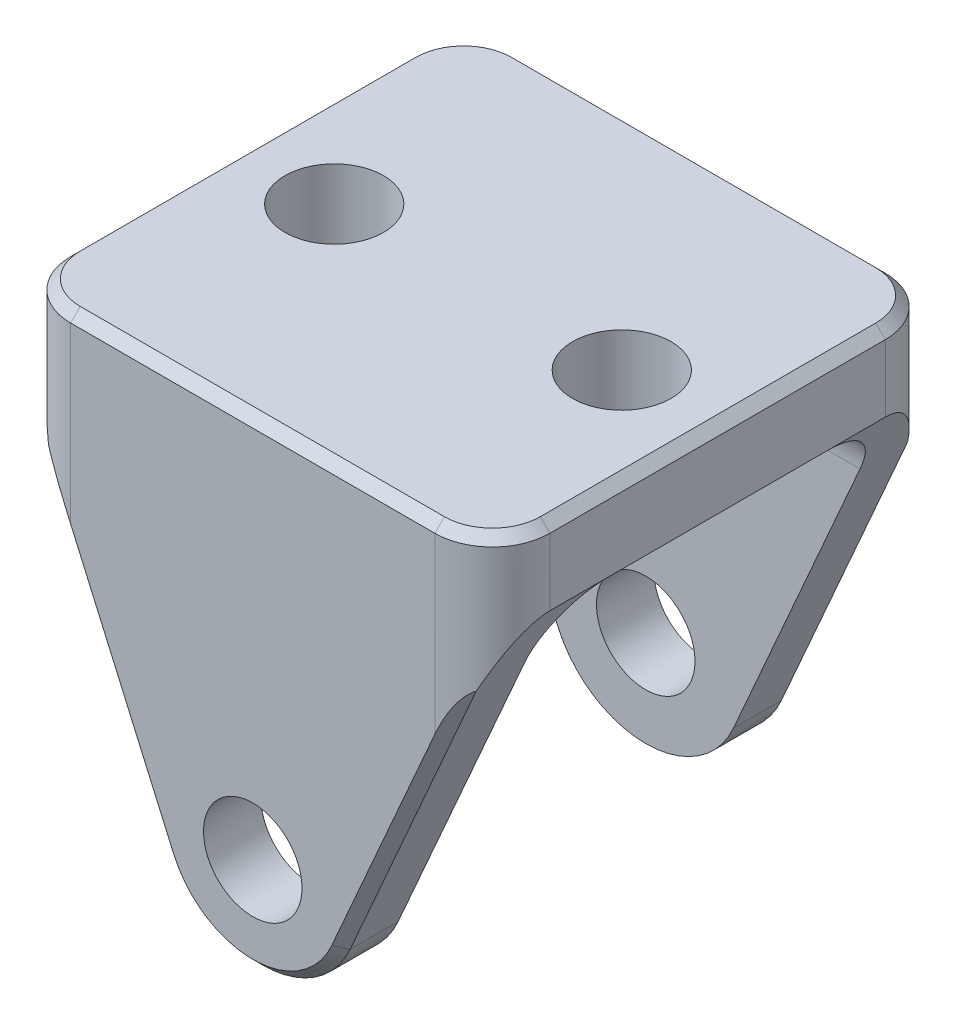
ISO-10303-21;
HEADER;
FILE_DESCRIPTION(('STEP AP214'),'2;1');
FILE_NAME('part.step','',(''),(''),'','','');
FILE_SCHEMA(('AUTOMOTIVE_DESIGN { 1 0 10303 214 1 1 1 1 }'));
ENDSEC;
DATA;
#1=APPLICATION_CONTEXT('core data for automotive mechanical design processes');
#2=APPLICATION_PROTOCOL_DEFINITION('international standard','automotive_design',2000,#1);
#3=PRODUCT_CONTEXT('',#1,'mechanical');
#4=PRODUCT('Part','Part','',(#3));
#5=PRODUCT_RELATED_PRODUCT_CATEGORY('part','',(#4));
#6=PRODUCT_DEFINITION_FORMATION('','',#4);
#7=PRODUCT_DEFINITION_CONTEXT('part definition',#1,'design');
#8=PRODUCT_DEFINITION('design','',#6,#7);
#9=PRODUCT_DEFINITION_SHAPE('','',#8);
#10=(LENGTH_UNIT() NAMED_UNIT(*) SI_UNIT(.MILLI.,.METRE.));
#11=(NAMED_UNIT(*) PLANE_ANGLE_UNIT() SI_UNIT($,.RADIAN.));
#12=(NAMED_UNIT(*) SI_UNIT($,.STERADIAN.) SOLID_ANGLE_UNIT());
#13=UNCERTAINTY_MEASURE_WITH_UNIT(LENGTH_MEASURE(1.E-05),#10,'distance_accuracy_value','');
#14=(GEOMETRIC_REPRESENTATION_CONTEXT(3) GLOBAL_UNCERTAINTY_ASSIGNED_CONTEXT((#13)) GLOBAL_UNIT_ASSIGNED_CONTEXT((#10,
#11,#12)) REPRESENTATION_CONTEXT('',''));
#15=CARTESIAN_POINT('',(0.,0.,0.));
#16=DIRECTION('',(0.,0.,1.));
#17=DIRECTION('',(1.,0.,0.));
#18=AXIS2_PLACEMENT_3D('',#15,#16,#17);
#19=CARTESIAN_POINT('',(15.24,520.7,306.5145));
#20=DIRECTION('',(0.,0.,-1.));
#21=DIRECTION('',(-1.,0.,0.));
#22=AXIS2_PLACEMENT_3D('',#19,#20,#21);
#23=CYLINDRICAL_SURFACE('',#22,6.34999999999999);
#24=DIRECTION('',(0.,0.,-1.));
#25=VECTOR('',#24,1.);
#26=CARTESIAN_POINT('',(21.0525596974217,518.143312736389,306.5145));
#27=LINE('',#26,#25);
#28=CARTESIAN_POINT('',(21.0525596974217,518.143312736389,305.8795));
#29=VERTEX_POINT('',#28);
#30=CARTESIAN_POINT('',(21.0525596974217,518.143312736389,302.7045));
#31=VERTEX_POINT('',#30);
#32=EDGE_CURVE('E225',#29,#31,#27,.T.);
#33=ORIENTED_EDGE('',*,*,#32,.F.);
#34=CARTESIAN_POINT('',(15.24,520.7,305.8795));
#35=DIRECTION('',(0.,0.,1.));
#36=DIRECTION('',(1.,0.,0.));
#37=AXIS2_PLACEMENT_3D('',#34,#35,#36);
#38=CIRCLE('',#37,6.34999999999999);
#39=CARTESIAN_POINT('',(9.42744030257833,518.143312736389,305.8795));
#40=VERTEX_POINT('',#39);
#41=EDGE_CURVE('E296',#29,#40,#38,.F.);
#42=ORIENTED_EDGE('',*,*,#41,.T.);
#43=DIRECTION('',(0.,0.,-1.));
#44=VECTOR('',#43,1.);
#45=CARTESIAN_POINT('',(9.42744030257833,518.143312736389,306.5145));
#46=LINE('',#45,#44);
#47=CARTESIAN_POINT('',(9.42744030257834,518.143312736389,302.7045));
#48=VERTEX_POINT('',#47);
#49=EDGE_CURVE('E232',#40,#48,#46,.T.);
#50=ORIENTED_EDGE('',*,*,#49,.T.);
#51=CARTESIAN_POINT('',(15.24,520.7,302.7045));
#52=DIRECTION('',(0.,0.,1.));
#53=DIRECTION('',(0.,-1.,0.));
#54=AXIS2_PLACEMENT_3D('',#51,#52,#53);
#55=CIRCLE('',#54,6.34999999999999);
#56=EDGE_CURVE('E237',#48,#31,#55,.T.);
#57=ORIENTED_EDGE('',*,*,#56,.T.);
#58=EDGE_LOOP('',(#33,#42,#50,#57));
#59=FACE_BOUND('',#58,.T.);
#60=ADVANCED_FACE('F40',(#59),#23,.T.);
#61=CARTESIAN_POINT('',(31.115,541.02,306.5145));
#62=DIRECTION('',(-0.91536373187743,0.402627915529243,0.));
#63=DIRECTION('',(-0.402627915529243,-0.91536373187743,0.));
#64=AXIS2_PLACEMENT_3D('',#61,#62,#63);
#65=PLANE('',#64);
#66=DIRECTION('',(0.,0.,-1.));
#67=VECTOR('',#66,1.);
#68=CARTESIAN_POINT('',(31.115,541.02,306.5145));
#69=LINE('',#68,#67);
#70=CARTESIAN_POINT('',(31.115,541.02,302.7045));
#71=VERTEX_POINT('',#70);
#72=CARTESIAN_POINT('',(31.115,541.02,298.8945));
#73=VERTEX_POINT('',#72);
#74=EDGE_CURVE('E244',#71,#73,#69,.T.);
#75=ORIENTED_EDGE('',*,*,#74,.F.);
#76=CARTESIAN_POINT('',(27.305,532.358067521054,302.7045));
#77=DIRECTION('',(-0.91536373187743,0.402627915529243,0.));
#78=DIRECTION('',(-0.402627915529244,-0.915363731877431,0.));
#79=AXIS2_PLACEMENT_3D('',#76,#77,#78);
#80=ELLIPSE('',#79,9.46283119736456,3.81);
#81=CARTESIAN_POINT('',(29.4110567418757,537.146130853063,305.8795));
#82=VERTEX_POINT('',#81);
#83=EDGE_CURVE('E343',#71,#82,#80,.F.);
#84=ORIENTED_EDGE('',*,*,#83,.T.);
#85=DIRECTION('',(-0.402627915529243,-0.91536373187743,0.));
#86=VECTOR('',#85,1.);
#87=CARTESIAN_POINT('',(21.0525596974217,518.143312736389,305.8795));
#88=LINE('',#87,#86);
#89=EDGE_CURVE('E298',#82,#29,#88,.T.);
#90=ORIENTED_EDGE('',*,*,#89,.T.);
#91=ORIENTED_EDGE('',*,*,#32,.T.);
#92=DIRECTION('',(0.402627915529243,0.91536373187743,0.));
#93=VECTOR('',#92,1.);
#94=CARTESIAN_POINT('',(31.115,541.02,302.7045));
#95=LINE('',#94,#93);
#96=CARTESIAN_POINT('',(29.4391499474531,537.21,302.7045));
#97=VERTEX_POINT('',#96);
#98=EDGE_CURVE('E233',#31,#97,#95,.T.);
#99=ORIENTED_EDGE('',*,*,#98,.T.);
#100=CARTESIAN_POINT('',(29.4391499474531,537.21,298.8945));
#101=DIRECTION('',(-0.91536373187743,0.402627915529243,0.));
#102=DIRECTION('',(-0.402627915529243,-0.91536373187743,0.));
#103=AXIS2_PLACEMENT_3D('',#100,#101,#102);
#104=ELLIPSE('',#103,4.16227983184959,3.81);
#105=EDGE_CURVE('E268',#97,#73,#104,.T.);
#106=ORIENTED_EDGE('',*,*,#105,.T.);
#107=EDGE_LOOP('',(#75,#84,#90,#91,#99,#106));
#108=FACE_BOUND('',#107,.T.);
#109=ADVANCED_FACE('F454',(#108),#65,.F.);
#110=CARTESIAN_POINT('',(9.42744030257833,518.143312736389,306.5145));
#111=DIRECTION('',(0.91536373187743,0.402627915529244,0.));
#112=DIRECTION('',(-0.402627915529244,0.91536373187743,0.));
#113=AXIS2_PLACEMENT_3D('',#110,#111,#112);
#114=PLANE('',#113);
#115=DIRECTION('',(-0.402627915529244,0.91536373187743,0.));
#116=VECTOR('',#115,1.);
#117=CARTESIAN_POINT('',(-0.635000000000023,541.02,305.8795));
#118=LINE('',#117,#116);
#119=CARTESIAN_POINT('',(1.06894325812434,537.146130853063,305.8795));
#120=VERTEX_POINT('',#119);
#121=EDGE_CURVE('E293',#40,#120,#118,.T.);
#122=ORIENTED_EDGE('',*,*,#121,.T.);
#123=CARTESIAN_POINT('',(3.17499999999996,532.358067521054,302.7045));
#124=DIRECTION('',(0.91536373187743,0.402627915529244,0.));
#125=DIRECTION('',(-0.402627915529244,0.91536373187743,0.));
#126=AXIS2_PLACEMENT_3D('',#123,#124,#125);
#127=ELLIPSE('',#126,9.46283119736454,3.81);
#128=CARTESIAN_POINT('',(-0.635000000000018,541.02,302.7045));
#129=VERTEX_POINT('',#128);
#130=EDGE_CURVE('E341',#120,#129,#127,.F.);
#131=ORIENTED_EDGE('',*,*,#130,.T.);
#132=DIRECTION('',(0.,0.,-1.));
#133=VECTOR('',#132,1.);
#134=CARTESIAN_POINT('',(-0.635000000000018,541.02,306.5145));
#135=LINE('',#134,#133);
#136=CARTESIAN_POINT('',(-0.635000000000018,541.02,298.8945));
#137=VERTEX_POINT('',#136);
#138=EDGE_CURVE('E241',#129,#137,#135,.T.);
#139=ORIENTED_EDGE('',*,*,#138,.T.);
#140=CARTESIAN_POINT('',(1.04085005254689,537.21,298.8945));
#141=DIRECTION('',(0.91536373187743,0.402627915529244,0.));
#142=DIRECTION('',(-0.402627915529244,0.91536373187743,0.));
#143=AXIS2_PLACEMENT_3D('',#140,#141,#142);
#144=ELLIPSE('',#143,4.16227983184958,3.81);
#145=CARTESIAN_POINT('',(1.04085005254689,537.21,302.7045));
#146=VERTEX_POINT('',#145);
#147=EDGE_CURVE('E271',#137,#146,#144,.T.);
#148=ORIENTED_EDGE('',*,*,#147,.T.);
#149=DIRECTION('',(0.402627915529244,-0.91536373187743,0.));
#150=VECTOR('',#149,1.);
#151=CARTESIAN_POINT('',(9.42744030257833,518.143312736389,302.7045));
#152=LINE('',#151,#150);
#153=EDGE_CURVE('E224',#146,#48,#152,.T.);
#154=ORIENTED_EDGE('',*,*,#153,.T.);
#155=ORIENTED_EDGE('',*,*,#49,.F.);
#156=EDGE_LOOP('',(#122,#131,#139,#148,#154,#155));
#157=FACE_BOUND('',#156,.T.);
#158=ADVANCED_FACE('F436',(#157),#114,.F.);
#159=CARTESIAN_POINT('',(9.42744030257832,518.143312736389,280.4795));
#160=VERTEX_POINT('',#159);
#161=CARTESIAN_POINT('',(9.42744030257833,518.143312736389,277.3045));
#162=VERTEX_POINT('',#161);
#163=EDGE_CURVE('E208',#160,#162,#46,.T.);
#164=ORIENTED_EDGE('',*,*,#163,.T.);
#165=CARTESIAN_POINT('',(15.24,520.7,277.3045));
#166=DIRECTION('',(0.,0.,1.));
#167=DIRECTION('',(1.,0.,0.));
#168=AXIS2_PLACEMENT_3D('',#165,#166,#167);
#169=CIRCLE('',#168,6.34999999999999);
#170=CARTESIAN_POINT('',(21.0525596974217,518.143312736389,277.3045));
#171=VERTEX_POINT('',#170);
#172=EDGE_CURVE('E281',#162,#171,#169,.T.);
#173=ORIENTED_EDGE('',*,*,#172,.T.);
#174=CARTESIAN_POINT('',(21.0525596974217,518.143312736389,280.4795));
#175=VERTEX_POINT('',#174);
#176=EDGE_CURVE('E210',#175,#171,#27,.T.);
#177=ORIENTED_EDGE('',*,*,#176,.F.);
#178=CARTESIAN_POINT('',(15.24,520.7,280.4795));
#179=DIRECTION('',(0.,0.,-1.));
#180=DIRECTION('',(0.,1.,0.));
#181=AXIS2_PLACEMENT_3D('',#178,#179,#180);
#182=CIRCLE('',#181,6.34999999999999);
#183=EDGE_CURVE('E204',#175,#160,#182,.T.);
#184=ORIENTED_EDGE('',*,*,#183,.T.);
#185=EDGE_LOOP('',(#164,#173,#177,#184));
#186=FACE_BOUND('',#185,.T.);
#187=ADVANCED_FACE('F206',(#186),#23,.T.);
#188=DIRECTION('',(0.402627915529243,0.91536373187743,0.));
#189=VECTOR('',#188,1.);
#190=CARTESIAN_POINT('',(31.115,541.02,277.3045));
#191=LINE('',#190,#189);
#192=CARTESIAN_POINT('',(29.4110567418757,537.146130853064,277.3045));
#193=VERTEX_POINT('',#192);
#194=EDGE_CURVE('E283',#171,#193,#191,.T.);
#195=ORIENTED_EDGE('',*,*,#194,.T.);
#196=CARTESIAN_POINT('',(27.305,532.358067521054,280.4795));
#197=DIRECTION('',(-0.91536373187743,0.402627915529243,0.));
#198=DIRECTION('',(0.402627915529244,0.915363731877431,0.));
#199=AXIS2_PLACEMENT_3D('',#196,#197,#198);
#200=ELLIPSE('',#199,9.46283119736456,3.81);
#201=CARTESIAN_POINT('',(31.115,541.02,280.4795));
#202=VERTEX_POINT('',#201);
#203=EDGE_CURVE('E332',#193,#202,#200,.F.);
#204=ORIENTED_EDGE('',*,*,#203,.T.);
#205=CARTESIAN_POINT('',(31.115,541.02,284.2895));
#206=VERTEX_POINT('',#205);
#207=EDGE_CURVE('E243',#206,#202,#69,.T.);
#208=ORIENTED_EDGE('',*,*,#207,.F.);
#209=CARTESIAN_POINT('',(29.4391499474531,537.21,284.2895));
#210=DIRECTION('',(-0.91536373187743,0.402627915529243,0.));
#211=DIRECTION('',(-0.402627915529243,-0.91536373187743,0.));
#212=AXIS2_PLACEMENT_3D('',#209,#210,#211);
#213=ELLIPSE('',#212,4.16227983184959,3.81);
#214=CARTESIAN_POINT('',(29.4391499474531,537.21,280.4795));
#215=VERTEX_POINT('',#214);
#216=EDGE_CURVE('E264',#206,#215,#213,.T.);
#217=ORIENTED_EDGE('',*,*,#216,.T.);
#218=DIRECTION('',(-0.402627915529243,-0.91536373187743,0.));
#219=VECTOR('',#218,1.);
#220=CARTESIAN_POINT('',(31.115,541.02,280.4795));
#221=LINE('',#220,#219);
#222=EDGE_CURVE('E213',#215,#175,#221,.T.);
#223=ORIENTED_EDGE('',*,*,#222,.T.);
#224=ORIENTED_EDGE('',*,*,#176,.T.);
#225=EDGE_LOOP('',(#195,#204,#208,#217,#223,#224));
#226=FACE_BOUND('',#225,.T.);
#227=ADVANCED_FACE('F525',(#226),#65,.F.);
#228=CARTESIAN_POINT('',(31.115,546.1,306.5145));
#229=DIRECTION('',(-1.,0.,0.));
#230=DIRECTION('',(0.,-1.,0.));
#231=AXIS2_PLACEMENT_3D('',#228,#229,#230);
#232=PLANE('',#231);
#233=DIRECTION('',(0.,1.,0.));
#234=VECTOR('',#233,1.);
#235=CARTESIAN_POINT('',(31.115,546.1,280.4795));
#236=LINE('',#235,#234);
#237=CARTESIAN_POINT('',(31.115,545.465,280.4795));
#238=VERTEX_POINT('',#237);
#239=EDGE_CURVE('E328',#202,#238,#236,.T.);
#240=ORIENTED_EDGE('',*,*,#239,.T.);
#241=DIRECTION('',(0.,0.,1.));
#242=VECTOR('',#241,1.);
#243=CARTESIAN_POINT('',(31.115,545.465,306.5145));
#244=LINE('',#243,#242);
#245=CARTESIAN_POINT('',(31.115,545.465,302.7045));
#246=VERTEX_POINT('',#245);
#247=EDGE_CURVE('E11',#238,#246,#244,.T.);
#248=ORIENTED_EDGE('',*,*,#247,.T.);
#249=DIRECTION('',(0.,1.,0.));
#250=VECTOR('',#249,1.);
#251=CARTESIAN_POINT('',(31.115,542.597138532894,302.7045));
#252=LINE('',#251,#250);
#253=EDGE_CURVE('E326',#246,#71,#252,.F.);
#254=ORIENTED_EDGE('',*,*,#253,.T.);
#255=ORIENTED_EDGE('',*,*,#74,.T.);
#256=DIRECTION('',(0.,0.,1.));
#257=VECTOR('',#256,1.);
#258=CARTESIAN_POINT('',(31.115,541.02,280.4795));
#259=LINE('',#258,#257);
#260=EDGE_CURVE('E443',#206,#73,#259,.T.);
#261=ORIENTED_EDGE('',*,*,#260,.F.);
#262=ORIENTED_EDGE('',*,*,#207,.T.);
#263=EDGE_LOOP('',(#240,#248,#254,#255,#261,#262));
#264=FACE_BOUND('',#263,.T.);
#265=ADVANCED_FACE('F532',(#264),#232,.F.);
#266=CARTESIAN_POINT('',(-0.635000000000007,546.1,306.5145));
#267=DIRECTION('',(0.,-1.,0.));
#268=DIRECTION('',(0.,0.,-1.));
#269=AXIS2_PLACEMENT_3D('',#266,#267,#268);
#270=PLANE('',#269);
#271=CARTESIAN_POINT('',(3.17499999999999,546.1,280.4795));
#272=DIRECTION('',(0.,-1.,0.));
#273=DIRECTION('',(0.,0.,-1.));
#274=AXIS2_PLACEMENT_3D('',#271,#272,#273);
#275=CIRCLE('',#274,3.17499999999999);
#276=CARTESIAN_POINT('',(3.17499999999999,546.1,277.3045));
#277=VERTEX_POINT('',#276);
#278=CARTESIAN_POINT('',(0.,546.1,280.4795));
#279=VERTEX_POINT('',#278);
#280=EDGE_CURVE('E360',#277,#279,#275,.F.);
#281=ORIENTED_EDGE('',*,*,#280,.T.);
#282=DIRECTION('',(0.,0.,1.));
#283=VECTOR('',#282,1.);
#284=CARTESIAN_POINT('',(0.,546.1,306.5145));
#285=LINE('',#284,#283);
#286=CARTESIAN_POINT('',(0.,546.1,302.7045));
#287=VERTEX_POINT('',#286);
#288=EDGE_CURVE('E364',#279,#287,#285,.T.);
#289=ORIENTED_EDGE('',*,*,#288,.T.);
#290=CARTESIAN_POINT('',(3.17499999999999,546.1,302.7045));
#291=DIRECTION('',(0.,-1.,0.));
#292=DIRECTION('',(0.,0.,-1.));
#293=AXIS2_PLACEMENT_3D('',#290,#291,#292);
#294=CIRCLE('',#293,3.17499999999998);
#295=CARTESIAN_POINT('',(3.17499999999999,546.1,305.8795));
#296=VERTEX_POINT('',#295);
#297=EDGE_CURVE('E362',#287,#296,#294,.F.);
#298=ORIENTED_EDGE('',*,*,#297,.T.);
#299=DIRECTION('',(1.,0.,0.));
#300=VECTOR('',#299,1.);
#301=CARTESIAN_POINT('',(27.305,546.1,305.8795));
#302=LINE('',#301,#300);
#303=CARTESIAN_POINT('',(27.305,546.1,305.8795));
#304=VERTEX_POINT('',#303);
#305=EDGE_CURVE('E358',#296,#304,#302,.T.);
#306=ORIENTED_EDGE('',*,*,#305,.T.);
#307=CARTESIAN_POINT('',(27.305,546.1,302.7045));
#308=DIRECTION('',(0.,-1.,0.));
#309=DIRECTION('',(0.,0.,-1.));
#310=AXIS2_PLACEMENT_3D('',#307,#308,#309);
#311=CIRCLE('',#310,3.17499999999998);
#312=CARTESIAN_POINT('',(30.48,546.1,302.7045));
#313=VERTEX_POINT('',#312);
#314=EDGE_CURVE('E354',#304,#313,#311,.F.);
#315=ORIENTED_EDGE('',*,*,#314,.T.);
#316=DIRECTION('',(0.,0.,-1.));
#317=VECTOR('',#316,1.);
#318=CARTESIAN_POINT('',(30.48,546.1,306.5145));
#319=LINE('',#318,#317);
#320=CARTESIAN_POINT('',(30.48,546.1,280.4795));
#321=VERTEX_POINT('',#320);
#322=EDGE_CURVE('E350',#313,#321,#319,.T.);
#323=ORIENTED_EDGE('',*,*,#322,.T.);
#324=CARTESIAN_POINT('',(27.305,546.1,280.4795));
#325=DIRECTION('',(0.,-1.,0.));
#326=DIRECTION('',(0.,0.,-1.));
#327=AXIS2_PLACEMENT_3D('',#324,#325,#326);
#328=CIRCLE('',#327,3.17499999999998);
#329=CARTESIAN_POINT('',(27.305,546.1,277.3045));
#330=VERTEX_POINT('',#329);
#331=EDGE_CURVE('E352',#321,#330,#328,.F.);
#332=ORIENTED_EDGE('',*,*,#331,.T.);
#333=DIRECTION('',(-1.,0.,0.));
#334=VECTOR('',#333,1.);
#335=CARTESIAN_POINT('',(-0.635000000000007,546.1,277.3045));
#336=LINE('',#335,#334);
#337=EDGE_CURVE('E356',#330,#277,#336,.T.);
#338=ORIENTED_EDGE('',*,*,#337,.T.);
#339=EDGE_LOOP('',(#281,#289,#298,#306,#315,#323,#332,#338));
#340=FACE_BOUND('',#339,.T.);
#341=CARTESIAN_POINT('',(24.765,546.1,291.592));
#342=DIRECTION('',(0.,-1.,0.));
#343=DIRECTION('',(0.,0.,-1.));
#344=AXIS2_PLACEMENT_3D('',#341,#342,#343);
#345=CIRCLE('',#344,3.2639);
#346=CARTESIAN_POINT('',(24.765,546.1,288.3281));
#347=VERTEX_POINT('',#346);
#348=EDGE_CURVE('E490',#347,#347,#345,.T.);
#349=ORIENTED_EDGE('',*,*,#348,.T.);
#350=EDGE_LOOP('',(#349));
#351=FACE_BOUND('',#350,.T.);
#352=CARTESIAN_POINT('',(5.71499999999998,546.1,291.592));
#353=DIRECTION('',(0.,-1.,0.));
#354=DIRECTION('',(0.,0.,-1.));
#355=AXIS2_PLACEMENT_3D('',#352,#353,#354);
#356=CIRCLE('',#355,3.2639);
#357=CARTESIAN_POINT('',(5.71499999999998,546.1,288.3281));
#358=VERTEX_POINT('',#357);
#359=EDGE_CURVE('E484',#358,#358,#356,.T.);
#360=ORIENTED_EDGE('',*,*,#359,.T.);
#361=EDGE_LOOP('',(#360));
#362=FACE_BOUND('',#361,.T.);
#363=ADVANCED_FACE('F408',(#340,#351,#362),#270,.F.);
#364=CARTESIAN_POINT('',(-0.635000000000018,541.02,306.5145));
#365=DIRECTION('',(1.,0.,0.));
#366=DIRECTION('',(0.,1.,0.));
#367=AXIS2_PLACEMENT_3D('',#364,#365,#366);
#368=PLANE('',#367);
#369=DIRECTION('',(0.,-1.,0.));
#370=VECTOR('',#369,1.);
#371=CARTESIAN_POINT('',(-0.635000000000007,546.1,302.7045));
#372=LINE('',#371,#370);
#373=CARTESIAN_POINT('',(-0.635000000000008,545.465,302.7045));
#374=VERTEX_POINT('',#373);
#375=EDGE_CURVE('E300',#129,#374,#372,.F.);
#376=ORIENTED_EDGE('',*,*,#375,.T.);
#377=DIRECTION('',(0.,0.,-1.));
#378=VECTOR('',#377,1.);
#379=CARTESIAN_POINT('',(-0.635000000000008,545.465,306.5145));
#380=LINE('',#379,#378);
#381=CARTESIAN_POINT('',(-0.635000000000008,545.465,280.4795));
#382=VERTEX_POINT('',#381);
#383=EDGE_CURVE('E347',#374,#382,#380,.T.);
#384=ORIENTED_EDGE('',*,*,#383,.T.);
#385=DIRECTION('',(0.,-1.,0.));
#386=VECTOR('',#385,1.);
#387=CARTESIAN_POINT('',(-0.635000000000018,541.02,280.4795));
#388=LINE('',#387,#386);
#389=CARTESIAN_POINT('',(-0.635000000000018,541.02,280.4795));
#390=VERTEX_POINT('',#389);
#391=EDGE_CURVE('E315',#382,#390,#388,.T.);
#392=ORIENTED_EDGE('',*,*,#391,.T.);
#393=CARTESIAN_POINT('',(-0.635000000000018,541.02,284.2895));
#394=VERTEX_POINT('',#393);
#395=EDGE_CURVE('E235',#394,#390,#135,.T.);
#396=ORIENTED_EDGE('',*,*,#395,.F.);
#397=DIRECTION('',(0.,0.,1.));
#398=VECTOR('',#397,1.);
#399=CARTESIAN_POINT('',(-0.635000000000018,541.02,280.4795));
#400=LINE('',#399,#398);
#401=EDGE_CURVE('E214',#394,#137,#400,.T.);
#402=ORIENTED_EDGE('',*,*,#401,.T.);
#403=ORIENTED_EDGE('',*,*,#138,.F.);
#404=EDGE_LOOP('',(#376,#384,#392,#396,#402,#403));
#405=FACE_BOUND('',#404,.T.);
#406=ADVANCED_FACE('F430',(#405),#368,.F.);
#407=ORIENTED_EDGE('',*,*,#395,.T.);
#408=CARTESIAN_POINT('',(3.17499999999996,532.358067521054,280.4795));
#409=DIRECTION('',(0.91536373187743,0.402627915529244,0.));
#410=DIRECTION('',(0.402627915529244,-0.91536373187743,0.));
#411=AXIS2_PLACEMENT_3D('',#408,#409,#410);
#412=ELLIPSE('',#411,9.46283119736454,3.81);
#413=CARTESIAN_POINT('',(1.06894325812424,537.146130853064,277.3045));
#414=VERTEX_POINT('',#413);
#415=EDGE_CURVE('E317',#390,#414,#412,.F.);
#416=ORIENTED_EDGE('',*,*,#415,.T.);
#417=DIRECTION('',(0.402627915529244,-0.91536373187743,0.));
#418=VECTOR('',#417,1.);
#419=CARTESIAN_POINT('',(9.42744030257833,518.143312736389,277.3045));
#420=LINE('',#419,#418);
#421=EDGE_CURVE('E230',#414,#162,#420,.T.);
#422=ORIENTED_EDGE('',*,*,#421,.T.);
#423=ORIENTED_EDGE('',*,*,#163,.F.);
#424=DIRECTION('',(-0.402627915529244,0.91536373187743,0.));
#425=VECTOR('',#424,1.);
#426=CARTESIAN_POINT('',(9.42744030257831,518.143312736389,280.4795));
#427=LINE('',#426,#425);
#428=CARTESIAN_POINT('',(1.04085005254687,537.21,280.4795));
#429=VERTEX_POINT('',#428);
#430=EDGE_CURVE('E217',#160,#429,#427,.T.);
#431=ORIENTED_EDGE('',*,*,#430,.T.);
#432=CARTESIAN_POINT('',(1.04085005254689,537.21,284.2895));
#433=DIRECTION('',(0.91536373187743,0.402627915529244,0.));
#434=DIRECTION('',(-0.402627915529244,0.91536373187743,0.));
#435=AXIS2_PLACEMENT_3D('',#432,#433,#434);
#436=ELLIPSE('',#435,4.16227983184958,3.81);
#437=EDGE_CURVE('E266',#429,#394,#436,.T.);
#438=ORIENTED_EDGE('',*,*,#437,.T.);
#439=EDGE_LOOP('',(#407,#416,#422,#423,#431,#438));
#440=FACE_BOUND('',#439,.T.);
#441=ADVANCED_FACE('F228',(#440),#114,.F.);
#442=CARTESIAN_POINT('',(15.24,520.7,306.5145));
#443=DIRECTION('',(0.,0.,1.));
#444=DIRECTION('',(1.,0.,0.));
#445=AXIS2_PLACEMENT_3D('',#442,#443,#444);
#446=PLANE('',#445);
#447=CARTESIAN_POINT('',(15.24,520.7,306.5145));
#448=DIRECTION('',(0.,0.,1.));
#449=DIRECTION('',(1.,0.,0.));
#450=AXIS2_PLACEMENT_3D('',#447,#448,#449);
#451=CIRCLE('',#450,3.2639);
#452=CARTESIAN_POINT('',(18.5039,520.7,306.5145));
#453=VERTEX_POINT('',#452);
#454=EDGE_CURVE('E481',#453,#453,#451,.T.);
#455=ORIENTED_EDGE('',*,*,#454,.F.);
#456=EDGE_LOOP('',(#455));
#457=FACE_BOUND('',#456,.T.);
#458=DIRECTION('',(0.,1.,0.));
#459=VECTOR('',#458,1.);
#460=CARTESIAN_POINT('',(27.305,546.1,306.5145));
#461=LINE('',#460,#459);
#462=CARTESIAN_POINT('',(27.305,533.935206053948,306.5145));
#463=VERTEX_POINT('',#462);
#464=CARTESIAN_POINT('',(27.305,545.465,306.5145));
#465=VERTEX_POINT('',#464);
#466=EDGE_CURVE('E334',#463,#465,#461,.T.);
#467=ORIENTED_EDGE('',*,*,#466,.T.);
#468=DIRECTION('',(-1.,0.,0.));
#469=VECTOR('',#468,1.);
#470=CARTESIAN_POINT('',(3.17499999999999,545.465,306.5145));
#471=LINE('',#470,#469);
#472=CARTESIAN_POINT('',(3.17499999999999,545.465,306.5145));
#473=VERTEX_POINT('',#472);
#474=EDGE_CURVE('E371',#465,#473,#471,.T.);
#475=ORIENTED_EDGE('',*,*,#474,.T.);
#476=DIRECTION('',(0.,-1.,0.));
#477=VECTOR('',#476,1.);
#478=CARTESIAN_POINT('',(3.17499999999998,542.597138532894,306.5145));
#479=LINE('',#478,#477);
#480=CARTESIAN_POINT('',(3.17499999999997,533.935206053948,306.5145));
#481=VERTEX_POINT('',#480);
#482=EDGE_CURVE('E337',#473,#481,#479,.T.);
#483=ORIENTED_EDGE('',*,*,#482,.T.);
#484=DIRECTION('',(0.402627915529244,-0.91536373187743,0.));
#485=VECTOR('',#484,1.);
#486=CARTESIAN_POINT('',(10.0086962723205,518.39898146275,306.5145));
#487=LINE('',#486,#485);
#488=CARTESIAN_POINT('',(10.0086962723204,518.39898146275,306.5145));
#489=VERTEX_POINT('',#488);
#490=EDGE_CURVE('E291',#481,#489,#487,.T.);
#491=ORIENTED_EDGE('',*,*,#490,.T.);
#492=CARTESIAN_POINT('',(15.24,520.7,306.5145));
#493=DIRECTION('',(0.,0.,1.));
#494=DIRECTION('',(1.,0.,0.));
#495=AXIS2_PLACEMENT_3D('',#492,#493,#494);
#496=CIRCLE('',#495,5.71500000000003);
#497=CARTESIAN_POINT('',(20.4713037276795,518.39898146275,306.5145));
#498=VERTEX_POINT('',#497);
#499=EDGE_CURVE('E289',#489,#498,#496,.T.);
#500=ORIENTED_EDGE('',*,*,#499,.T.);
#501=DIRECTION('',(0.402627915529244,0.915363731877431,0.));
#502=VECTOR('',#501,1.);
#503=CARTESIAN_POINT('',(30.5337440302579,541.275668726361,306.5145));
#504=LINE('',#503,#502);
#505=EDGE_CURVE('E286',#498,#463,#504,.T.);
#506=ORIENTED_EDGE('',*,*,#505,.T.);
#507=EDGE_LOOP('',(#467,#475,#483,#491,#500,#506));
#508=FACE_BOUND('',#507,.T.);
#509=ADVANCED_FACE('F540',(#457,#508),#446,.T.);
#510=CARTESIAN_POINT('',(15.24,520.7,276.6695));
#511=DIRECTION('',(0.,0.,1.));
#512=DIRECTION('',(1.,0.,0.));
#513=AXIS2_PLACEMENT_3D('',#510,#511,#512);
#514=PLANE('',#513);
#515=CARTESIAN_POINT('',(15.24,520.7,276.6695));
#516=DIRECTION('',(0.,0.,1.));
#517=DIRECTION('',(1.,0.,0.));
#518=AXIS2_PLACEMENT_3D('',#515,#516,#517);
#519=CIRCLE('',#518,3.26389999999999);
#520=CARTESIAN_POINT('',(18.5039,520.7,276.6695));
#521=VERTEX_POINT('',#520);
#522=EDGE_CURVE('E254',#521,#521,#519,.T.);
#523=ORIENTED_EDGE('',*,*,#522,.T.);
#524=EDGE_LOOP('',(#523));
#525=FACE_BOUND('',#524,.T.);
#526=DIRECTION('',(0.,-1.,0.));
#527=VECTOR('',#526,1.);
#528=CARTESIAN_POINT('',(3.17499999999994,520.7,276.6695));
#529=LINE('',#528,#527);
#530=CARTESIAN_POINT('',(3.17499999999996,533.935206053948,276.6695));
#531=VERTEX_POINT('',#530);
#532=CARTESIAN_POINT('',(3.17499999999999,545.465,276.6695));
#533=VERTEX_POINT('',#532);
#534=EDGE_CURVE('E323',#531,#533,#529,.F.);
#535=ORIENTED_EDGE('',*,*,#534,.T.);
#536=DIRECTION('',(1.,0.,0.));
#537=VECTOR('',#536,1.);
#538=CARTESIAN_POINT('',(15.24,545.465,276.6695));
#539=LINE('',#538,#537);
#540=CARTESIAN_POINT('',(27.305,545.465,276.6695));
#541=VERTEX_POINT('',#540);
#542=EDGE_CURVE('E373',#533,#541,#539,.T.);
#543=ORIENTED_EDGE('',*,*,#542,.T.);
#544=DIRECTION('',(0.,1.,0.));
#545=VECTOR('',#544,1.);
#546=CARTESIAN_POINT('',(27.305,520.7,276.6695));
#547=LINE('',#546,#545);
#548=CARTESIAN_POINT('',(27.305,533.935206053948,276.6695));
#549=VERTEX_POINT('',#548);
#550=EDGE_CURVE('E321',#541,#549,#547,.F.);
#551=ORIENTED_EDGE('',*,*,#550,.T.);
#552=DIRECTION('',(-0.402627915529244,-0.915363731877431,0.));
#553=VECTOR('',#552,1.);
#554=CARTESIAN_POINT('',(20.4713037276795,518.39898146275,276.6695));
#555=LINE('',#554,#553);
#556=CARTESIAN_POINT('',(20.4713037276795,518.39898146275,276.6695));
#557=VERTEX_POINT('',#556);
#558=EDGE_CURVE('E274',#549,#557,#555,.T.);
#559=ORIENTED_EDGE('',*,*,#558,.T.);
#560=CARTESIAN_POINT('',(15.24,520.7,276.6695));
#561=DIRECTION('',(0.,0.,1.));
#562=DIRECTION('',(1.,0.,0.));
#563=AXIS2_PLACEMENT_3D('',#560,#561,#562);
#564=CIRCLE('',#563,5.71499999999999);
#565=CARTESIAN_POINT('',(10.0086962723205,518.39898146275,276.6695));
#566=VERTEX_POINT('',#565);
#567=EDGE_CURVE('E276',#557,#566,#564,.F.);
#568=ORIENTED_EDGE('',*,*,#567,.T.);
#569=DIRECTION('',(-0.402627915529244,0.91536373187743,0.));
#570=VECTOR('',#569,1.);
#571=CARTESIAN_POINT('',(10.0086962723205,518.39898146275,276.6695));
#572=LINE('',#571,#570);
#573=EDGE_CURVE('E278',#566,#531,#572,.T.);
#574=ORIENTED_EDGE('',*,*,#573,.T.);
#575=EDGE_LOOP('',(#535,#543,#551,#559,#568,#574));
#576=FACE_BOUND('',#575,.T.);
#577=ADVANCED_FACE('F545',(#525,#576),#514,.F.);
#578=CARTESIAN_POINT('',(-0.635000000000019,541.02,302.7045));
#579=DIRECTION('',(0.,0.,1.));
#580=DIRECTION('',(0.,-1.,0.));
#581=AXIS2_PLACEMENT_3D('',#578,#579,#580);
#582=PLANE('',#581);
#583=CARTESIAN_POINT('',(15.24,520.7,302.7045));
#584=DIRECTION('',(0.,0.,1.));
#585=DIRECTION('',(0.,-1.,0.));
#586=AXIS2_PLACEMENT_3D('',#583,#584,#585);
#587=CIRCLE('',#586,3.26389999999999);
#588=CARTESIAN_POINT('',(15.24,517.4361,302.7045));
#589=VERTEX_POINT('',#588);
#590=EDGE_CURVE('E253',#589,#589,#587,.T.);
#591=ORIENTED_EDGE('',*,*,#590,.T.);
#592=EDGE_LOOP('',(#591));
#593=FACE_BOUND('',#592,.T.);
#594=ORIENTED_EDGE('',*,*,#153,.F.);
#595=DIRECTION('',(1.,0.,0.));
#596=VECTOR('',#595,1.);
#597=CARTESIAN_POINT('',(31.115,537.21,302.7045));
#598=LINE('',#597,#596);
#599=EDGE_CURVE('E261',#146,#97,#598,.T.);
#600=ORIENTED_EDGE('',*,*,#599,.T.);
#601=ORIENTED_EDGE('',*,*,#98,.F.);
#602=ORIENTED_EDGE('',*,*,#56,.F.);
#603=EDGE_LOOP('',(#594,#600,#601,#602));
#604=FACE_BOUND('',#603,.T.);
#605=ADVANCED_FACE('F449',(#593,#604),#582,.F.);
#606=CARTESIAN_POINT('',(-0.635000000000014,514.35,280.4795));
#607=DIRECTION('',(0.,0.,-1.));
#608=DIRECTION('',(0.,1.,0.));
#609=AXIS2_PLACEMENT_3D('',#606,#607,#608);
#610=PLANE('',#609);
#611=CARTESIAN_POINT('',(15.24,520.7,280.4795));
#612=DIRECTION('',(0.,0.,-1.));
#613=DIRECTION('',(0.,1.,0.));
#614=AXIS2_PLACEMENT_3D('',#611,#612,#613);
#615=CIRCLE('',#614,3.26389999999999);
#616=CARTESIAN_POINT('',(15.24,523.9639,280.4795));
#617=VERTEX_POINT('',#616);
#618=EDGE_CURVE('E250',#617,#617,#615,.T.);
#619=ORIENTED_EDGE('',*,*,#618,.T.);
#620=EDGE_LOOP('',(#619));
#621=FACE_BOUND('',#620,.T.);
#622=ORIENTED_EDGE('',*,*,#222,.F.);
#623=DIRECTION('',(1.,0.,0.));
#624=VECTOR('',#623,1.);
#625=CARTESIAN_POINT('',(-0.635000000000017,537.21,280.4795));
#626=LINE('',#625,#624);
#627=EDGE_CURVE('E220',#215,#429,#626,.F.);
#628=ORIENTED_EDGE('',*,*,#627,.T.);
#629=ORIENTED_EDGE('',*,*,#430,.F.);
#630=ORIENTED_EDGE('',*,*,#183,.F.);
#631=EDGE_LOOP('',(#622,#628,#629,#630));
#632=FACE_BOUND('',#631,.T.);
#633=ADVANCED_FACE('F218',(#621,#632),#610,.F.);
#634=CARTESIAN_POINT('',(-0.635000000000018,541.02,280.4795));
#635=DIRECTION('',(0.,1.,0.));
#636=DIRECTION('',(-1.,0.,0.));
#637=AXIS2_PLACEMENT_3D('',#634,#635,#636);
#638=PLANE('',#637);
#639=CARTESIAN_POINT('',(24.765,541.02,291.592));
#640=DIRECTION('',(0.,-1.,0.));
#641=DIRECTION('',(0.,0.,-1.));
#642=AXIS2_PLACEMENT_3D('',#639,#640,#641);
#643=CIRCLE('',#642,3.26389999999999);
#644=CARTESIAN_POINT('',(24.765,541.02,288.3281));
#645=VERTEX_POINT('',#644);
#646=EDGE_CURVE('E307',#645,#645,#643,.T.);
#647=ORIENTED_EDGE('',*,*,#646,.F.);
#648=EDGE_LOOP('',(#647));
#649=FACE_BOUND('',#648,.T.);
#650=CARTESIAN_POINT('',(5.71499999999998,541.02,291.592));
#651=DIRECTION('',(0.,-1.,0.));
#652=DIRECTION('',(0.,0.,-1.));
#653=AXIS2_PLACEMENT_3D('',#650,#651,#652);
#654=CIRCLE('',#653,3.26389999999999);
#655=CARTESIAN_POINT('',(5.71499999999998,541.02,288.3281));
#656=VERTEX_POINT('',#655);
#657=EDGE_CURVE('E487',#656,#656,#654,.T.);
#658=ORIENTED_EDGE('',*,*,#657,.F.);
#659=EDGE_LOOP('',(#658));
#660=FACE_BOUND('',#659,.T.);
#661=ORIENTED_EDGE('',*,*,#401,.F.);
#662=DIRECTION('',(1.,0.,0.));
#663=VECTOR('',#662,1.);
#664=CARTESIAN_POINT('',(31.115,541.02,284.2895));
#665=LINE('',#664,#663);
#666=EDGE_CURVE('E257',#394,#206,#665,.T.);
#667=ORIENTED_EDGE('',*,*,#666,.T.);
#668=ORIENTED_EDGE('',*,*,#260,.T.);
#669=DIRECTION('',(1.,0.,0.));
#670=VECTOR('',#669,1.);
#671=CARTESIAN_POINT('',(-0.635000000000017,541.02,298.8945));
#672=LINE('',#671,#670);
#673=EDGE_CURVE('E249',#73,#137,#672,.F.);
#674=ORIENTED_EDGE('',*,*,#673,.T.);
#675=EDGE_LOOP('',(#661,#667,#668,#674));
#676=FACE_BOUND('',#675,.T.);
#677=ADVANCED_FACE('F441',(#649,#660,#676),#638,.F.);
#678=CARTESIAN_POINT('',(15.24,520.7,306.5145));
#679=DIRECTION('',(0.,0.,1.));
#680=DIRECTION('',(1.,0.,0.));
#681=AXIS2_PLACEMENT_3D('',#678,#679,#680);
#682=CYLINDRICAL_SURFACE('',#681,3.26389999999999);
#683=ORIENTED_EDGE('',*,*,#522,.F.);
#684=EDGE_LOOP('',(#683));
#685=FACE_BOUND('',#684,.T.);
#686=ORIENTED_EDGE('',*,*,#618,.F.);
#687=EDGE_LOOP('',(#686));
#688=FACE_BOUND('',#687,.T.);
#689=ADVANCED_FACE('F500',(#685,#688),#682,.F.);
#690=ORIENTED_EDGE('',*,*,#454,.T.);
#691=EDGE_LOOP('',(#690));
#692=FACE_BOUND('',#691,.T.);
#693=ORIENTED_EDGE('',*,*,#590,.F.);
#694=EDGE_LOOP('',(#693));
#695=FACE_BOUND('',#694,.T.);
#696=ADVANCED_FACE('F506',(#692,#695),#682,.F.);
#697=CARTESIAN_POINT('',(5.71499999999998,541.02,291.592));
#698=DIRECTION('',(0.,-1.,0.));
#699=DIRECTION('',(0.,0.,-1.));
#700=AXIS2_PLACEMENT_3D('',#697,#698,#699);
#701=CYLINDRICAL_SURFACE('',#700,3.26389999999999);
#702=ORIENTED_EDGE('',*,*,#359,.F.);
#703=EDGE_LOOP('',(#702));
#704=FACE_BOUND('',#703,.T.);
#705=ORIENTED_EDGE('',*,*,#657,.T.);
#706=EDGE_LOOP('',(#705));
#707=FACE_BOUND('',#706,.T.);
#708=ADVANCED_FACE('F504',(#704,#707),#701,.F.);
#709=CARTESIAN_POINT('',(24.765,541.02,291.592));
#710=DIRECTION('',(0.,-1.,0.));
#711=DIRECTION('',(0.,0.,-1.));
#712=AXIS2_PLACEMENT_3D('',#709,#710,#711);
#713=CYLINDRICAL_SURFACE('',#712,3.26389999999999);
#714=ORIENTED_EDGE('',*,*,#348,.F.);
#715=EDGE_LOOP('',(#714));
#716=FACE_BOUND('',#715,.T.);
#717=ORIENTED_EDGE('',*,*,#646,.T.);
#718=EDGE_LOOP('',(#717));
#719=FACE_BOUND('',#718,.T.);
#720=ADVANCED_FACE('F496',(#716,#719),#713,.F.);
#721=CARTESIAN_POINT('',(-0.635000000000017,537.21,284.2895));
#722=DIRECTION('',(-1.,0.,0.));
#723=DIRECTION('',(0.,-1.,0.));
#724=AXIS2_PLACEMENT_3D('',#721,#722,#723);
#725=CYLINDRICAL_SURFACE('',#724,3.81);
#726=ORIENTED_EDGE('',*,*,#437,.F.);
#727=ORIENTED_EDGE('',*,*,#627,.F.);
#728=ORIENTED_EDGE('',*,*,#216,.F.);
#729=ORIENTED_EDGE('',*,*,#666,.F.);
#730=EDGE_LOOP('',(#726,#727,#728,#729));
#731=FACE_BOUND('',#730,.T.);
#732=ADVANCED_FACE('F513',(#731),#725,.F.);
#733=CARTESIAN_POINT('',(-0.635000000000018,537.21,298.8945));
#734=DIRECTION('',(-1.,0.,0.));
#735=DIRECTION('',(0.,-1.,0.));
#736=AXIS2_PLACEMENT_3D('',#733,#734,#735);
#737=CYLINDRICAL_SURFACE('',#736,3.81);
#738=ORIENTED_EDGE('',*,*,#147,.F.);
#739=ORIENTED_EDGE('',*,*,#673,.F.);
#740=ORIENTED_EDGE('',*,*,#105,.F.);
#741=ORIENTED_EDGE('',*,*,#599,.F.);
#742=EDGE_LOOP('',(#738,#739,#740,#741));
#743=FACE_BOUND('',#742,.T.);
#744=ADVANCED_FACE('F445',(#743),#737,.F.);
#745=CARTESIAN_POINT('',(31.115,541.02,277.3045));
#746=DIRECTION('',(-0.647259902062756,0.284700929365733,0.707106781186548));
#747=DIRECTION('',(0.402627915529243,0.91536373187743,0.));
#748=AXIS2_PLACEMENT_3D('',#745,#746,#747);
#749=PLANE('',#748);
#750=ORIENTED_EDGE('',*,*,#558,.F.);
#751=CARTESIAN_POINT('',(27.305,524.472374856584,280.4795));
#752=DIRECTION('',(-0.647259902062756,0.284700929365733,0.707106781186548));
#753=DIRECTION('',(0.19223069605027,0.958616388769923,-0.210004711084634));
#754=AXIS2_PLACEMENT_3D('',#751,#752,#753);
#755=ELLIPSE('',#754,13.3824642177602,3.81);
#756=EDGE_CURVE('E330',#549,#193,#755,.F.);
#757=ORIENTED_EDGE('',*,*,#756,.T.);
#758=ORIENTED_EDGE('',*,*,#194,.F.);
#759=DIRECTION('',(0.647259902062755,-0.284700929365734,0.707106781186548));
#760=VECTOR('',#759,1.);
#761=CARTESIAN_POINT('',(20.4713037276795,518.39898146275,276.6695));
#762=LINE('',#761,#760);
#763=EDGE_CURVE('E303',#557,#171,#762,.T.);
#764=ORIENTED_EDGE('',*,*,#763,.F.);
#765=EDGE_LOOP('',(#750,#757,#758,#764));
#766=FACE_BOUND('',#765,.T.);
#767=ADVANCED_FACE('F564',(#766),#749,.F.);
#768=CARTESIAN_POINT('',(15.24,520.7,277.3045));
#769=DIRECTION('',(0.,0.,1.));
#770=DIRECTION('',(1.,0.,0.));
#771=AXIS2_PLACEMENT_3D('',#768,#769,#770);
#772=CONICAL_SURFACE('',#771,6.34999999999999,0.785398163397447);
#773=ORIENTED_EDGE('',*,*,#763,.T.);
#774=ORIENTED_EDGE('',*,*,#172,.F.);
#775=DIRECTION('',(-0.647259902062755,-0.284700929365734,0.707106781186548));
#776=VECTOR('',#775,1.);
#777=CARTESIAN_POINT('',(10.0086962723205,518.39898146275,276.6695));
#778=LINE('',#777,#776);
#779=EDGE_CURVE('E301',#566,#162,#778,.T.);
#780=ORIENTED_EDGE('',*,*,#779,.F.);
#781=ORIENTED_EDGE('',*,*,#567,.F.);
#782=EDGE_LOOP('',(#773,#774,#780,#781));
#783=FACE_BOUND('',#782,.T.);
#784=ADVANCED_FACE('F568',(#783),#772,.T.);
#785=CARTESIAN_POINT('',(9.42744030257833,518.143312736389,277.3045));
#786=DIRECTION('',(0.647259902062756,0.284700929365733,0.707106781186547));
#787=DIRECTION('',(0.402627915529244,-0.91536373187743,0.));
#788=AXIS2_PLACEMENT_3D('',#785,#786,#787);
#789=PLANE('',#788);
#790=ORIENTED_EDGE('',*,*,#421,.F.);
#791=CARTESIAN_POINT('',(3.17499999999995,524.472374856584,280.4795));
#792=DIRECTION('',(0.647259902062756,0.284700929365733,0.707106781186547));
#793=DIRECTION('',(0.19223069605027,-0.958616388769923,0.210004711084634));
#794=AXIS2_PLACEMENT_3D('',#791,#792,#793);
#795=ELLIPSE('',#794,13.3824642177602,3.81);
#796=EDGE_CURVE('E319',#414,#531,#795,.F.);
#797=ORIENTED_EDGE('',*,*,#796,.T.);
#798=ORIENTED_EDGE('',*,*,#573,.F.);
#799=ORIENTED_EDGE('',*,*,#779,.T.);
#800=EDGE_LOOP('',(#790,#797,#798,#799));
#801=FACE_BOUND('',#800,.T.);
#802=ADVANCED_FACE('F574',(#801),#789,.F.);
#803=CARTESIAN_POINT('',(20.4713037276795,518.39898146275,306.5145));
#804=DIRECTION('',(0.647259902062741,-0.284700929365726,0.707106781186564));
#805=DIRECTION('',(-0.402627915529243,-0.91536373187743,0.));
#806=AXIS2_PLACEMENT_3D('',#803,#804,#805);
#807=PLANE('',#806);
#808=ORIENTED_EDGE('',*,*,#89,.F.);
#809=CARTESIAN_POINT('',(27.305,524.472374856583,302.7045));
#810=DIRECTION('',(0.647259902062741,-0.284700929365726,0.707106781186564));
#811=DIRECTION('',(-0.192230696050261,-0.958616388769925,-0.210004711084633));
#812=AXIS2_PLACEMENT_3D('',#809,#810,#811);
#813=ELLIPSE('',#812,13.3824642177605,3.81);
#814=EDGE_CURVE('E345',#82,#463,#813,.T.);
#815=ORIENTED_EDGE('',*,*,#814,.T.);
#816=ORIENTED_EDGE('',*,*,#505,.F.);
#817=DIRECTION('',(-0.647259902062763,0.284700929365752,0.707106781186533));
#818=VECTOR('',#817,1.);
#819=CARTESIAN_POINT('',(21.0525596974217,518.143312736389,305.8795));
#820=LINE('',#819,#818);
#821=EDGE_CURVE('E304',#29,#498,#820,.T.);
#822=ORIENTED_EDGE('',*,*,#821,.F.);
#823=EDGE_LOOP('',(#808,#815,#816,#822));
#824=FACE_BOUND('',#823,.T.);
#825=ADVANCED_FACE('F463',(#824),#807,.T.);
#826=CARTESIAN_POINT('',(15.24,520.7,306.5145));
#827=DIRECTION('',(0.,0.,-1.));
#828=DIRECTION('',(-1.,0.,0.));
#829=AXIS2_PLACEMENT_3D('',#826,#827,#828);
#830=CONICAL_SURFACE('',#829,5.71500000000003,0.785398163397458);
#831=ORIENTED_EDGE('',*,*,#821,.T.);
#832=ORIENTED_EDGE('',*,*,#499,.F.);
#833=DIRECTION('',(0.647259902062754,0.284700929365755,0.70710678118654));
#834=VECTOR('',#833,1.);
#835=CARTESIAN_POINT('',(9.42744030257833,518.143312736389,305.8795));
#836=LINE('',#835,#834);
#837=EDGE_CURVE('E308',#40,#489,#836,.T.);
#838=ORIENTED_EDGE('',*,*,#837,.F.);
#839=ORIENTED_EDGE('',*,*,#41,.F.);
#840=EDGE_LOOP('',(#831,#832,#838,#839));
#841=FACE_BOUND('',#840,.T.);
#842=ADVANCED_FACE('F468',(#841),#830,.T.);
#843=CARTESIAN_POINT('',(10.0086962723205,518.39898146275,306.5145));
#844=DIRECTION('',(-0.647259902062741,-0.284700929365726,0.707106781186564));
#845=DIRECTION('',(-0.402627915529244,0.91536373187743,0.));
#846=AXIS2_PLACEMENT_3D('',#843,#844,#845);
#847=PLANE('',#846);
#848=ORIENTED_EDGE('',*,*,#490,.F.);
#849=CARTESIAN_POINT('',(3.17499999999995,524.472374856583,302.7045));
#850=DIRECTION('',(-0.647259902062741,-0.284700929365726,0.707106781186564));
#851=DIRECTION('',(-0.192230696050261,0.958616388769925,0.210004711084634));
#852=AXIS2_PLACEMENT_3D('',#849,#850,#851);
#853=ELLIPSE('',#852,13.3824642177605,3.81);
#854=EDGE_CURVE('E339',#481,#120,#853,.T.);
#855=ORIENTED_EDGE('',*,*,#854,.T.);
#856=ORIENTED_EDGE('',*,*,#121,.F.);
#857=ORIENTED_EDGE('',*,*,#837,.T.);
#858=EDGE_LOOP('',(#848,#855,#856,#857));
#859=FACE_BOUND('',#858,.T.);
#860=ADVANCED_FACE('F472',(#859),#847,.T.);
#861=CARTESIAN_POINT('',(3.17499999999998,541.02,280.4795));
#862=DIRECTION('',(0.,-1.,0.));
#863=DIRECTION('',(1.,0.,0.));
#864=AXIS2_PLACEMENT_3D('',#861,#862,#863);
#865=CYLINDRICAL_SURFACE('',#864,3.81);
#866=ORIENTED_EDGE('',*,*,#391,.F.);
#867=CARTESIAN_POINT('',(3.17499999999999,545.465,280.4795));
#868=DIRECTION('',(0.,-1.,0.));
#869=DIRECTION('',(1.,0.,0.));
#870=AXIS2_PLACEMENT_3D('',#867,#868,#869);
#871=CIRCLE('',#870,3.81);
#872=EDGE_CURVE('E369',#382,#533,#871,.T.);
#873=ORIENTED_EDGE('',*,*,#872,.T.);
#874=ORIENTED_EDGE('',*,*,#534,.F.);
#875=ORIENTED_EDGE('',*,*,#796,.F.);
#876=ORIENTED_EDGE('',*,*,#415,.F.);
#877=EDGE_LOOP('',(#866,#873,#874,#875,#876));
#878=FACE_BOUND('',#877,.T.);
#879=ADVANCED_FACE('F578',(#878),#865,.T.);
#880=CARTESIAN_POINT('',(27.305,546.1,280.4795));
#881=DIRECTION('',(0.,1.,0.));
#882=DIRECTION('',(-1.,0.,0.));
#883=AXIS2_PLACEMENT_3D('',#880,#881,#882);
#884=CYLINDRICAL_SURFACE('',#883,3.81);
#885=ORIENTED_EDGE('',*,*,#550,.F.);
#886=CARTESIAN_POINT('',(27.305,545.465,280.4795));
#887=DIRECTION('',(0.,-1.,0.));
#888=DIRECTION('',(0.,0.,-1.));
#889=AXIS2_PLACEMENT_3D('',#886,#887,#888);
#890=CIRCLE('',#889,3.81);
#891=EDGE_CURVE('E50',#541,#238,#890,.T.);
#892=ORIENTED_EDGE('',*,*,#891,.T.);
#893=ORIENTED_EDGE('',*,*,#239,.F.);
#894=ORIENTED_EDGE('',*,*,#203,.F.);
#895=ORIENTED_EDGE('',*,*,#756,.F.);
#896=EDGE_LOOP('',(#885,#892,#893,#894,#895));
#897=FACE_BOUND('',#896,.T.);
#898=ADVANCED_FACE('F557',(#897),#884,.T.);
#899=CARTESIAN_POINT('',(3.17499999999994,520.7,302.7045));
#900=DIRECTION('',(0.,1.,0.));
#901=DIRECTION('',(-1.,0.,0.));
#902=AXIS2_PLACEMENT_3D('',#899,#900,#901);
#903=CYLINDRICAL_SURFACE('',#902,3.81);
#904=ORIENTED_EDGE('',*,*,#482,.F.);
#905=CARTESIAN_POINT('',(3.17499999999999,545.465,302.7045));
#906=DIRECTION('',(0.,-1.,0.));
#907=DIRECTION('',(1.,0.,0.));
#908=AXIS2_PLACEMENT_3D('',#905,#906,#907);
#909=CIRCLE('',#908,3.81);
#910=EDGE_CURVE('E367',#473,#374,#909,.T.);
#911=ORIENTED_EDGE('',*,*,#910,.T.);
#912=ORIENTED_EDGE('',*,*,#375,.F.);
#913=ORIENTED_EDGE('',*,*,#130,.F.);
#914=ORIENTED_EDGE('',*,*,#854,.F.);
#915=EDGE_LOOP('',(#904,#911,#912,#913,#914));
#916=FACE_BOUND('',#915,.T.);
#917=ADVANCED_FACE('F425',(#916),#903,.T.);
#918=CARTESIAN_POINT('',(27.305,520.7,302.7045));
#919=DIRECTION('',(0.,-1.,0.));
#920=DIRECTION('',(1.,0.,0.));
#921=AXIS2_PLACEMENT_3D('',#918,#919,#920);
#922=CYLINDRICAL_SURFACE('',#921,3.81);
#923=ORIENTED_EDGE('',*,*,#253,.F.);
#924=CARTESIAN_POINT('',(27.305,545.465,302.7045));
#925=DIRECTION('',(0.,-1.,0.));
#926=DIRECTION('',(0.,0.,-1.));
#927=AXIS2_PLACEMENT_3D('',#924,#925,#926);
#928=CIRCLE('',#927,3.81);
#929=EDGE_CURVE('E375',#246,#465,#928,.T.);
#930=ORIENTED_EDGE('',*,*,#929,.T.);
#931=ORIENTED_EDGE('',*,*,#466,.F.);
#932=ORIENTED_EDGE('',*,*,#814,.F.);
#933=ORIENTED_EDGE('',*,*,#83,.F.);
#934=EDGE_LOOP('',(#923,#930,#931,#932,#933));
#935=FACE_BOUND('',#934,.T.);
#936=ADVANCED_FACE('F603',(#935),#922,.T.);
#937=CARTESIAN_POINT('',(30.48,546.1,306.5145));
#938=DIRECTION('',(-0.707106781186567,-0.707106781186528,0.));
#939=DIRECTION('',(0.,0.,-1.));
#940=AXIS2_PLACEMENT_3D('',#937,#938,#939);
#941=PLANE('',#940);
#942=DIRECTION('',(0.707106781186528,-0.707106781186567,0.));
#943=VECTOR('',#942,1.);
#944=CARTESIAN_POINT('',(30.48,546.1,280.4795));
#945=LINE('',#944,#943);
#946=EDGE_CURVE('E393',#321,#238,#945,.T.);
#947=ORIENTED_EDGE('',*,*,#946,.F.);
#948=ORIENTED_EDGE('',*,*,#322,.F.);
#949=DIRECTION('',(-0.707106781186528,0.707106781186567,0.));
#950=VECTOR('',#949,1.);
#951=CARTESIAN_POINT('',(31.115,545.465,302.7045));
#952=LINE('',#951,#950);
#953=EDGE_CURVE('E45',#246,#313,#952,.T.);
#954=ORIENTED_EDGE('',*,*,#953,.F.);
#955=ORIENTED_EDGE('',*,*,#247,.F.);
#956=EDGE_LOOP('',(#947,#948,#954,#955));
#957=FACE_BOUND('',#956,.T.);
#958=ADVANCED_FACE('F43',(#957),#941,.F.);
#959=CARTESIAN_POINT('',(27.305,546.1,302.7045));
#960=DIRECTION('',(0.,-1.,0.));
#961=DIRECTION('',(0.,0.,-1.));
#962=AXIS2_PLACEMENT_3D('',#959,#960,#961);
#963=CONICAL_SURFACE('',#962,3.17499999999998,0.78539816339742);
#964=ORIENTED_EDGE('',*,*,#953,.T.);
#965=ORIENTED_EDGE('',*,*,#314,.F.);
#966=DIRECTION('',(0.,0.707106781186579,-0.707106781186517));
#967=VECTOR('',#966,1.);
#968=CARTESIAN_POINT('',(27.305,545.465,306.5145));
#969=LINE('',#968,#967);
#970=EDGE_CURVE('E391',#465,#304,#969,.T.);
#971=ORIENTED_EDGE('',*,*,#970,.F.);
#972=ORIENTED_EDGE('',*,*,#929,.F.);
#973=EDGE_LOOP('',(#964,#965,#971,#972));
#974=FACE_BOUND('',#973,.T.);
#975=ADVANCED_FACE('F403',(#974),#963,.T.);
#976=CARTESIAN_POINT('',(27.305,546.1,280.4795));
#977=DIRECTION('',(0.,-1.,0.));
#978=DIRECTION('',(0.,0.,-1.));
#979=AXIS2_PLACEMENT_3D('',#976,#977,#978);
#980=CONICAL_SURFACE('',#979,3.17499999999998,0.78539816339742);
#981=ORIENTED_EDGE('',*,*,#946,.T.);
#982=ORIENTED_EDGE('',*,*,#891,.F.);
#983=DIRECTION('',(0.,-0.707106781186579,-0.707106781186517));
#984=VECTOR('',#983,1.);
#985=CARTESIAN_POINT('',(27.305,546.1,277.3045));
#986=LINE('',#985,#984);
#987=EDGE_CURVE('E388',#330,#541,#986,.T.);
#988=ORIENTED_EDGE('',*,*,#987,.F.);
#989=ORIENTED_EDGE('',*,*,#331,.F.);
#990=EDGE_LOOP('',(#981,#982,#988,#989));
#991=FACE_BOUND('',#990,.T.);
#992=ADVANCED_FACE('F624',(#991),#980,.T.);
#993=CARTESIAN_POINT('',(15.24,545.465,306.5145));
#994=DIRECTION('',(0.,0.707106781186517,0.707106781186579));
#995=DIRECTION('',(1.,0.,0.));
#996=AXIS2_PLACEMENT_3D('',#993,#994,#995);
#997=PLANE('',#996);
#998=ORIENTED_EDGE('',*,*,#970,.T.);
#999=ORIENTED_EDGE('',*,*,#305,.F.);
#1000=DIRECTION('',(0.,0.707106781186579,-0.707106781186517));
#1001=VECTOR('',#1000,1.);
#1002=CARTESIAN_POINT('',(3.17499999999999,545.465,306.5145));
#1003=LINE('',#1002,#1001);
#1004=EDGE_CURVE('E385',#473,#296,#1003,.T.);
#1005=ORIENTED_EDGE('',*,*,#1004,.F.);
#1006=ORIENTED_EDGE('',*,*,#474,.F.);
#1007=EDGE_LOOP('',(#998,#999,#1005,#1006));
#1008=FACE_BOUND('',#1007,.T.);
#1009=ADVANCED_FACE('F415',(#1008),#997,.T.);
#1010=CARTESIAN_POINT('',(-0.635000000000007,546.1,277.3045));
#1011=DIRECTION('',(0.,-0.707106781186517,0.707106781186579));
#1012=DIRECTION('',(-1.,0.,0.));
#1013=AXIS2_PLACEMENT_3D('',#1010,#1011,#1012);
#1014=PLANE('',#1013);
#1015=ORIENTED_EDGE('',*,*,#987,.T.);
#1016=ORIENTED_EDGE('',*,*,#542,.F.);
#1017=DIRECTION('',(0.,-0.707106781186579,-0.707106781186517));
#1018=VECTOR('',#1017,1.);
#1019=CARTESIAN_POINT('',(3.17499999999999,546.1,277.3045));
#1020=LINE('',#1019,#1018);
#1021=EDGE_CURVE('E382',#277,#533,#1020,.T.);
#1022=ORIENTED_EDGE('',*,*,#1021,.F.);
#1023=ORIENTED_EDGE('',*,*,#337,.F.);
#1024=EDGE_LOOP('',(#1015,#1016,#1022,#1023));
#1025=FACE_BOUND('',#1024,.T.);
#1026=ADVANCED_FACE('F583',(#1025),#1014,.F.);
#1027=CARTESIAN_POINT('',(3.17499999999999,546.1,302.7045));
#1028=DIRECTION('',(0.,-1.,0.));
#1029=DIRECTION('',(1.,0.,0.));
#1030=AXIS2_PLACEMENT_3D('',#1027,#1028,#1029);
#1031=CONICAL_SURFACE('',#1030,3.17499999999998,0.78539816339742);
#1032=ORIENTED_EDGE('',*,*,#1004,.T.);
#1033=ORIENTED_EDGE('',*,*,#297,.F.);
#1034=DIRECTION('',(0.707106781186528,0.707106781186567,0.));
#1035=VECTOR('',#1034,1.);
#1036=CARTESIAN_POINT('',(-0.635000000000009,545.465,302.7045));
#1037=LINE('',#1036,#1035);
#1038=EDGE_CURVE('E380',#374,#287,#1037,.T.);
#1039=ORIENTED_EDGE('',*,*,#1038,.F.);
#1040=ORIENTED_EDGE('',*,*,#910,.F.);
#1041=EDGE_LOOP('',(#1032,#1033,#1039,#1040));
#1042=FACE_BOUND('',#1041,.T.);
#1043=ADVANCED_FACE('F419',(#1042),#1031,.T.);
#1044=CARTESIAN_POINT('',(3.17499999999999,546.1,280.4795));
#1045=DIRECTION('',(0.,-1.,0.));
#1046=DIRECTION('',(1.,0.,0.));
#1047=AXIS2_PLACEMENT_3D('',#1044,#1045,#1046);
#1048=CONICAL_SURFACE('',#1047,3.17499999999998,0.78539816339742);
#1049=ORIENTED_EDGE('',*,*,#1021,.T.);
#1050=ORIENTED_EDGE('',*,*,#872,.F.);
#1051=DIRECTION('',(-0.707106781186525,-0.707106781186571,0.));
#1052=VECTOR('',#1051,1.);
#1053=CARTESIAN_POINT('',(0.,546.1,280.4795));
#1054=LINE('',#1053,#1052);
#1055=EDGE_CURVE('E378',#279,#382,#1054,.T.);
#1056=ORIENTED_EDGE('',*,*,#1055,.F.);
#1057=ORIENTED_EDGE('',*,*,#280,.F.);
#1058=EDGE_LOOP('',(#1049,#1050,#1056,#1057));
#1059=FACE_BOUND('',#1058,.T.);
#1060=ADVANCED_FACE('F587',(#1059),#1048,.T.);
#1061=CARTESIAN_POINT('',(-0.635000000000008,545.465,306.5145));
#1062=DIRECTION('',(0.707106781186567,-0.707106781186528,0.));
#1063=DIRECTION('',(0.,0.,-1.));
#1064=AXIS2_PLACEMENT_3D('',#1061,#1062,#1063);
#1065=PLANE('',#1064);
#1066=ORIENTED_EDGE('',*,*,#1038,.T.);
#1067=ORIENTED_EDGE('',*,*,#288,.F.);
#1068=ORIENTED_EDGE('',*,*,#1055,.T.);
#1069=ORIENTED_EDGE('',*,*,#383,.F.);
#1070=EDGE_LOOP('',(#1066,#1067,#1068,#1069));
#1071=FACE_BOUND('',#1070,.T.);
#1072=ADVANCED_FACE('F591',(#1071),#1065,.F.);
#1073=CLOSED_SHELL('',(#60,#109,#158,#187,#227,#265,#363,#406,#441,#509,#577,#605,#633,#677,
#689,#696,#708,#720,#732,#744,#767,#784,#802,#825,#842,#860,#879,#898,#917,#936,#958,#975,#992,
#1009,#1026,#1043,#1060,#1072));
#1074=MANIFOLD_SOLID_BREP('B2',#1073);
#1075=ADVANCED_BREP_SHAPE_REPRESENTATION('',(#18,#1074),#14);
#1076=SHAPE_DEFINITION_REPRESENTATION(#9,#1075);
ENDSEC;
END-ISO-10303-21;
